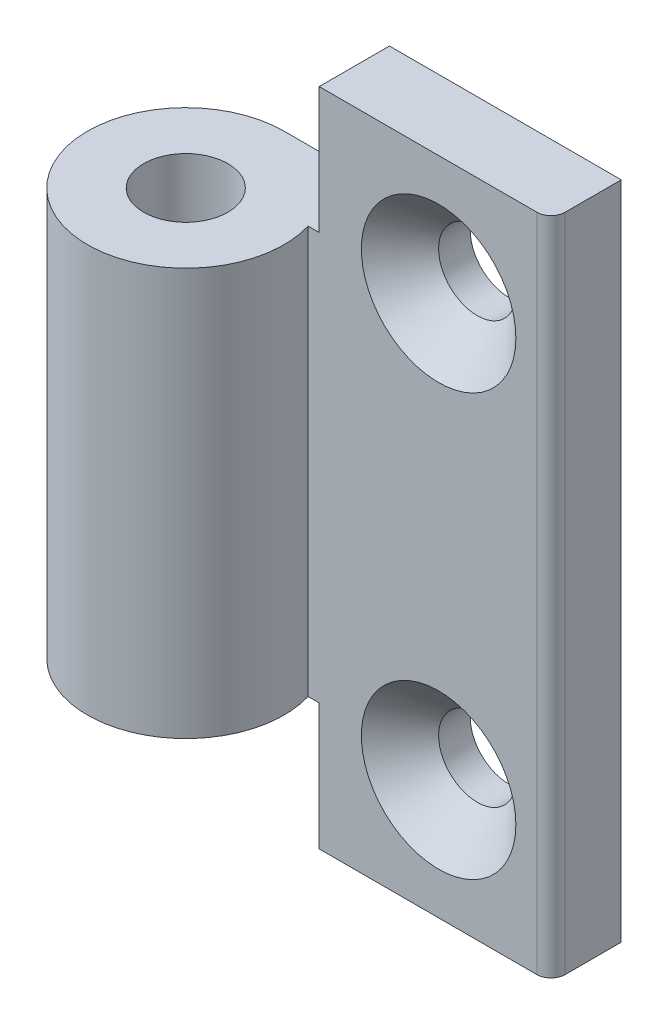
ISO-10303-21;
HEADER;
FILE_DESCRIPTION(('STEP AP214'),'2;1');
FILE_NAME('part.step','',(''),(''),'','','');
FILE_SCHEMA(('AUTOMOTIVE_DESIGN { 1 0 10303 214 1 1 1 1 }'));
ENDSEC;
DATA;
#1=APPLICATION_CONTEXT('core data for automotive mechanical design processes');
#2=APPLICATION_PROTOCOL_DEFINITION('international standard','automotive_design',2000,#1);
#3=PRODUCT_CONTEXT('',#1,'mechanical');
#4=PRODUCT('Part','Part','',(#3));
#5=PRODUCT_RELATED_PRODUCT_CATEGORY('part','',(#4));
#6=PRODUCT_DEFINITION_FORMATION('','',#4);
#7=PRODUCT_DEFINITION_CONTEXT('part definition',#1,'design');
#8=PRODUCT_DEFINITION('design','',#6,#7);
#9=PRODUCT_DEFINITION_SHAPE('','',#8);
#10=(LENGTH_UNIT() NAMED_UNIT(*) SI_UNIT(.MILLI.,.METRE.));
#11=(NAMED_UNIT(*) PLANE_ANGLE_UNIT() SI_UNIT($,.RADIAN.));
#12=(NAMED_UNIT(*) SI_UNIT($,.STERADIAN.) SOLID_ANGLE_UNIT());
#13=UNCERTAINTY_MEASURE_WITH_UNIT(LENGTH_MEASURE(1.E-05),#10,'distance_accuracy_value','');
#14=(GEOMETRIC_REPRESENTATION_CONTEXT(3) GLOBAL_UNCERTAINTY_ASSIGNED_CONTEXT((#13)) GLOBAL_UNIT_ASSIGNED_CONTEXT((#10,
#11,#12)) REPRESENTATION_CONTEXT('',''));
#15=CARTESIAN_POINT('',(0.,0.,0.));
#16=DIRECTION('',(0.,0.,1.));
#17=DIRECTION('',(1.,0.,0.));
#18=AXIS2_PLACEMENT_3D('',#15,#16,#17);
#19=CARTESIAN_POINT('',(16.,-15.,-1.99999999995271));
#20=DIRECTION('',(0.,0.,1.));
#21=DIRECTION('',(1.,0.,0.));
#22=AXIS2_PLACEMENT_3D('',#19,#20,#21);
#23=CONICAL_SURFACE('',#22,5.50000000000318,0.785398163397448);
#24=CARTESIAN_POINT('',(16.,-15.,-4.75));
#25=DIRECTION('',(0.,0.,-1.));
#26=DIRECTION('',(-1.,0.,0.));
#27=AXIS2_PLACEMENT_3D('',#24,#25,#26);
#28=CIRCLE('',#27,2.75);
#29=CARTESIAN_POINT('',(13.25,-15.,-4.75));
#30=VERTEX_POINT('',#29);
#31=EDGE_CURVE('E156',#30,#30,#28,.T.);
#32=ORIENTED_EDGE('',*,*,#31,.T.);
#33=EDGE_LOOP('',(#32));
#34=FACE_BOUND('',#33,.T.);
#35=CARTESIAN_POINT('',(16.,-15.,-1.99999999995271));
#36=DIRECTION('',(0.,0.,1.));
#37=DIRECTION('',(1.,0.,0.));
#38=AXIS2_PLACEMENT_3D('',#35,#36,#37);
#39=CIRCLE('',#38,5.50000000000318);
#40=CARTESIAN_POINT('',(21.5000000000032,-15.,-1.99999999995271));
#41=VERTEX_POINT('',#40);
#42=EDGE_CURVE('E150',#41,#41,#39,.F.);
#43=ORIENTED_EDGE('',*,*,#42,.F.);
#44=EDGE_LOOP('',(#43));
#45=FACE_BOUND('',#44,.T.);
#46=ADVANCED_FACE('F16',(#34,#45),#23,.F.);
#47=CARTESIAN_POINT('',(16.,15.,-1.99999999995271));
#48=DIRECTION('',(0.,0.,1.));
#49=DIRECTION('',(1.,0.,0.));
#50=AXIS2_PLACEMENT_3D('',#47,#48,#49);
#51=CONICAL_SURFACE('',#50,5.50000000000318,0.785398163397448);
#52=CARTESIAN_POINT('',(16.,15.,-4.75));
#53=DIRECTION('',(0.,0.,-1.));
#54=DIRECTION('',(-1.,0.,0.));
#55=AXIS2_PLACEMENT_3D('',#52,#53,#54);
#56=CIRCLE('',#55,2.75);
#57=CARTESIAN_POINT('',(13.25,15.,-4.75));
#58=VERTEX_POINT('',#57);
#59=EDGE_CURVE('E142',#58,#58,#56,.T.);
#60=ORIENTED_EDGE('',*,*,#59,.T.);
#61=EDGE_LOOP('',(#60));
#62=FACE_BOUND('',#61,.T.);
#63=CARTESIAN_POINT('',(16.,15.,-1.99999999995271));
#64=DIRECTION('',(0.,0.,1.));
#65=DIRECTION('',(1.,0.,0.));
#66=AXIS2_PLACEMENT_3D('',#63,#64,#65);
#67=CIRCLE('',#66,5.50000000000318);
#68=CARTESIAN_POINT('',(21.5000000000032,15.,-1.99999999995271));
#69=VERTEX_POINT('',#68);
#70=EDGE_CURVE('E186',#69,#69,#67,.F.);
#71=ORIENTED_EDGE('',*,*,#70,.F.);
#72=EDGE_LOOP('',(#71));
#73=FACE_BOUND('',#72,.T.);
#74=ADVANCED_FACE('F373',(#62,#73),#51,.F.);
#75=CARTESIAN_POINT('',(23.,23.5,-3.));
#76=DIRECTION('',(0.,1.,0.));
#77=DIRECTION('',(0.,0.,1.));
#78=AXIS2_PLACEMENT_3D('',#75,#76,#77);
#79=CYLINDRICAL_SURFACE('',#78,1.);
#80=CARTESIAN_POINT('',(23.,23.5,-3.));
#81=DIRECTION('',(0.,1.,0.));
#82=DIRECTION('',(0.,0.,1.));
#83=AXIS2_PLACEMENT_3D('',#80,#81,#82);
#84=CIRCLE('',#83,1.);
#85=CARTESIAN_POINT('',(24.,23.5,-3.));
#86=VERTEX_POINT('',#85);
#87=CARTESIAN_POINT('',(23.,23.5,-2.));
#88=VERTEX_POINT('',#87);
#89=EDGE_CURVE('E115',#86,#88,#84,.F.);
#90=ORIENTED_EDGE('',*,*,#89,.T.);
#91=DIRECTION('',(0.,1.,0.));
#92=VECTOR('',#91,1.);
#93=CARTESIAN_POINT('',(23.,0.,-2.));
#94=LINE('',#93,#92);
#95=CARTESIAN_POINT('',(23.,-23.5,-2.));
#96=VERTEX_POINT('',#95);
#97=EDGE_CURVE('E178',#96,#88,#94,.T.);
#98=ORIENTED_EDGE('',*,*,#97,.F.);
#99=CARTESIAN_POINT('',(23.,-23.5,-3.));
#100=DIRECTION('',(0.,1.,0.));
#101=DIRECTION('',(0.,0.,1.));
#102=AXIS2_PLACEMENT_3D('',#99,#100,#101);
#103=CIRCLE('',#102,1.);
#104=CARTESIAN_POINT('',(24.,-23.5,-3.));
#105=VERTEX_POINT('',#104);
#106=EDGE_CURVE('E19',#96,#105,#103,.T.);
#107=ORIENTED_EDGE('',*,*,#106,.T.);
#108=DIRECTION('',(0.,1.,0.));
#109=VECTOR('',#108,1.);
#110=CARTESIAN_POINT('',(24.,-23.5,-3.));
#111=LINE('',#110,#109);
#112=EDGE_CURVE('E116',#105,#86,#111,.T.);
#113=ORIENTED_EDGE('',*,*,#112,.T.);
#114=EDGE_LOOP('',(#90,#98,#107,#113));
#115=FACE_BOUND('',#114,.T.);
#116=ADVANCED_FACE('F364',(#115),#79,.T.);
#117=CARTESIAN_POINT('',(0.,-23.5,0.));
#118=DIRECTION('',(0.,1.,0.));
#119=DIRECTION('',(0.,0.,1.));
#120=AXIS2_PLACEMENT_3D('',#117,#118,#119);
#121=CYLINDRICAL_SURFACE('',#120,3.);
#122=CARTESIAN_POINT('',(0.,14.5,0.));
#123=DIRECTION('',(0.,1.,0.));
#124=DIRECTION('',(0.,0.,1.));
#125=AXIS2_PLACEMENT_3D('',#122,#123,#124);
#126=CIRCLE('',#125,3.);
#127=CARTESIAN_POINT('',(0.,14.5,3.));
#128=VERTEX_POINT('',#127);
#129=EDGE_CURVE('E173',#128,#128,#126,.T.);
#130=ORIENTED_EDGE('',*,*,#129,.T.);
#131=EDGE_LOOP('',(#130));
#132=FACE_BOUND('',#131,.T.);
#133=CARTESIAN_POINT('',(0.,-14.5,0.));
#134=DIRECTION('',(0.,1.,0.));
#135=DIRECTION('',(0.,0.,1.));
#136=AXIS2_PLACEMENT_3D('',#133,#134,#135);
#137=CIRCLE('',#136,3.);
#138=CARTESIAN_POINT('',(0.,-14.5,3.));
#139=VERTEX_POINT('',#138);
#140=EDGE_CURVE('E151',#139,#139,#137,.F.);
#141=ORIENTED_EDGE('',*,*,#140,.T.);
#142=EDGE_LOOP('',(#141));
#143=FACE_BOUND('',#142,.T.);
#144=ADVANCED_FACE('F355',(#132,#143),#121,.F.);
#145=CARTESIAN_POINT('',(16.,-15.,-2.));
#146=DIRECTION('',(0.,0.,-1.));
#147=DIRECTION('',(-1.,0.,0.));
#148=AXIS2_PLACEMENT_3D('',#145,#146,#147);
#149=CYLINDRICAL_SURFACE('',#148,2.75);
#150=CARTESIAN_POINT('',(16.,-15.,-7.));
#151=DIRECTION('',(0.,0.,-1.));
#152=DIRECTION('',(-1.,0.,0.));
#153=AXIS2_PLACEMENT_3D('',#150,#151,#152);
#154=CIRCLE('',#153,2.75);
#155=CARTESIAN_POINT('',(13.25,-15.,-7.));
#156=VERTEX_POINT('',#155);
#157=EDGE_CURVE('E199',#156,#156,#154,.T.);
#158=ORIENTED_EDGE('',*,*,#157,.T.);
#159=EDGE_LOOP('',(#158));
#160=FACE_BOUND('',#159,.T.);
#161=ORIENTED_EDGE('',*,*,#31,.F.);
#162=EDGE_LOOP('',(#161));
#163=FACE_BOUND('',#162,.T.);
#164=ADVANCED_FACE('F258',(#160,#163),#149,.F.);
#165=CARTESIAN_POINT('',(16.,15.,-2.));
#166=DIRECTION('',(0.,0.,-1.));
#167=DIRECTION('',(-1.,0.,0.));
#168=AXIS2_PLACEMENT_3D('',#165,#166,#167);
#169=CYLINDRICAL_SURFACE('',#168,2.75);
#170=CARTESIAN_POINT('',(16.,15.,-7.));
#171=DIRECTION('',(0.,0.,-1.));
#172=DIRECTION('',(-1.,0.,0.));
#173=AXIS2_PLACEMENT_3D('',#170,#171,#172);
#174=CIRCLE('',#173,2.75);
#175=CARTESIAN_POINT('',(13.25,15.,-7.));
#176=VERTEX_POINT('',#175);
#177=EDGE_CURVE('E196',#176,#176,#174,.T.);
#178=ORIENTED_EDGE('',*,*,#177,.T.);
#179=EDGE_LOOP('',(#178));
#180=FACE_BOUND('',#179,.T.);
#181=ORIENTED_EDGE('',*,*,#59,.F.);
#182=EDGE_LOOP('',(#181));
#183=FACE_BOUND('',#182,.T.);
#184=ADVANCED_FACE('F250',(#180,#183),#169,.F.);
#185=CARTESIAN_POINT('',(7.5,-14.5,7.));
#186=DIRECTION('',(1.,0.,0.));
#187=DIRECTION('',(0.,0.,-1.));
#188=AXIS2_PLACEMENT_3D('',#185,#186,#187);
#189=PLANE('',#188);
#190=DIRECTION('',(0.,0.,1.));
#191=VECTOR('',#190,1.);
#192=CARTESIAN_POINT('',(7.5,-14.5,7.));
#193=LINE('',#192,#191);
#194=CARTESIAN_POINT('',(7.5,-14.5,-2.));
#195=VERTEX_POINT('',#194);
#196=CARTESIAN_POINT('',(7.5,-14.5,-7.));
#197=VERTEX_POINT('',#196);
#198=EDGE_CURVE('E81',#195,#197,#193,.F.);
#199=ORIENTED_EDGE('',*,*,#198,.T.);
#200=DIRECTION('',(0.,1.,0.));
#201=VECTOR('',#200,1.);
#202=CARTESIAN_POINT('',(7.5,0.,-7.));
#203=LINE('',#202,#201);
#204=CARTESIAN_POINT('',(7.5,-23.5,-7.));
#205=VERTEX_POINT('',#204);
#206=EDGE_CURVE('E75',#197,#205,#203,.F.);
#207=ORIENTED_EDGE('',*,*,#206,.T.);
#208=DIRECTION('',(0.,0.,1.));
#209=VECTOR('',#208,1.);
#210=CARTESIAN_POINT('',(7.5,-23.5,0.));
#211=LINE('',#210,#209);
#212=CARTESIAN_POINT('',(7.5,-23.5,-2.));
#213=VERTEX_POINT('',#212);
#214=EDGE_CURVE('E67',#205,#213,#211,.T.);
#215=ORIENTED_EDGE('',*,*,#214,.T.);
#216=DIRECTION('',(0.,1.,0.));
#217=VECTOR('',#216,1.);
#218=CARTESIAN_POINT('',(7.5,0.,-2.));
#219=LINE('',#218,#217);
#220=EDGE_CURVE('E170',#195,#213,#219,.F.);
#221=ORIENTED_EDGE('',*,*,#220,.F.);
#222=EDGE_LOOP('',(#199,#207,#215,#221));
#223=FACE_BOUND('',#222,.T.);
#224=ADVANCED_FACE('F248',(#223),#189,.F.);
#225=CARTESIAN_POINT('',(7.,-23.5,0.));
#226=DIRECTION('',(0.,1.,0.));
#227=DIRECTION('',(0.,0.,1.));
#228=AXIS2_PLACEMENT_3D('',#225,#226,#227);
#229=PLANE('',#228);
#230=ORIENTED_EDGE('',*,*,#106,.F.);
#231=DIRECTION('',(1.,0.,0.));
#232=VECTOR('',#231,1.);
#233=CARTESIAN_POINT('',(0.,-23.5,-2.));
#234=LINE('',#233,#232);
#235=EDGE_CURVE('E183',#213,#96,#234,.T.);
#236=ORIENTED_EDGE('',*,*,#235,.F.);
#237=ORIENTED_EDGE('',*,*,#214,.F.);
#238=DIRECTION('',(1.,0.,0.));
#239=VECTOR('',#238,1.);
#240=CARTESIAN_POINT('',(0.,-23.5,-7.));
#241=LINE('',#240,#239);
#242=CARTESIAN_POINT('',(24.,-23.5,-7.));
#243=VERTEX_POINT('',#242);
#244=EDGE_CURVE('E109',#205,#243,#241,.T.);
#245=ORIENTED_EDGE('',*,*,#244,.T.);
#246=DIRECTION('',(0.,0.,1.));
#247=VECTOR('',#246,1.);
#248=CARTESIAN_POINT('',(24.,-23.5,-2.));
#249=LINE('',#248,#247);
#250=EDGE_CURVE('E104',#243,#105,#249,.T.);
#251=ORIENTED_EDGE('',*,*,#250,.T.);
#252=EDGE_LOOP('',(#230,#236,#237,#245,#251));
#253=FACE_BOUND('',#252,.T.);
#254=ADVANCED_FACE('F247',(#253),#229,.F.);
#255=CARTESIAN_POINT('',(24.,-23.5,-2.));
#256=DIRECTION('',(-1.,0.,0.));
#257=DIRECTION('',(0.,0.,1.));
#258=AXIS2_PLACEMENT_3D('',#255,#256,#257);
#259=PLANE('',#258);
#260=ORIENTED_EDGE('',*,*,#250,.F.);
#261=DIRECTION('',(0.,1.,0.));
#262=VECTOR('',#261,1.);
#263=CARTESIAN_POINT('',(24.,0.,-7.));
#264=LINE('',#263,#262);
#265=CARTESIAN_POINT('',(24.,23.5,-7.));
#266=VERTEX_POINT('',#265);
#267=EDGE_CURVE('E98',#243,#266,#264,.T.);
#268=ORIENTED_EDGE('',*,*,#267,.T.);
#269=DIRECTION('',(0.,0.,-1.));
#270=VECTOR('',#269,1.);
#271=CARTESIAN_POINT('',(24.,23.5,0.));
#272=LINE('',#271,#270);
#273=EDGE_CURVE('E102',#266,#86,#272,.F.);
#274=ORIENTED_EDGE('',*,*,#273,.T.);
#275=ORIENTED_EDGE('',*,*,#112,.F.);
#276=EDGE_LOOP('',(#260,#268,#274,#275));
#277=FACE_BOUND('',#276,.T.);
#278=ADVANCED_FACE('F100',(#277),#259,.F.);
#279=CARTESIAN_POINT('',(0.,23.5,0.));
#280=DIRECTION('',(0.,-1.,0.));
#281=DIRECTION('',(0.,0.,-1.));
#282=AXIS2_PLACEMENT_3D('',#279,#280,#281);
#283=PLANE('',#282);
#284=ORIENTED_EDGE('',*,*,#89,.F.);
#285=ORIENTED_EDGE('',*,*,#273,.F.);
#286=DIRECTION('',(1.,0.,0.));
#287=VECTOR('',#286,1.);
#288=CARTESIAN_POINT('',(0.,23.5,-7.));
#289=LINE('',#288,#287);
#290=CARTESIAN_POINT('',(7.5,23.5,-7.));
#291=VERTEX_POINT('',#290);
#292=EDGE_CURVE('E108',#266,#291,#289,.F.);
#293=ORIENTED_EDGE('',*,*,#292,.T.);
#294=DIRECTION('',(0.,0.,1.));
#295=VECTOR('',#294,1.);
#296=CARTESIAN_POINT('',(7.5,23.5,7.));
#297=LINE('',#296,#295);
#298=CARTESIAN_POINT('',(7.5,23.5,-2.));
#299=VERTEX_POINT('',#298);
#300=EDGE_CURVE('E211',#291,#299,#297,.T.);
#301=ORIENTED_EDGE('',*,*,#300,.T.);
#302=DIRECTION('',(1.,0.,0.));
#303=VECTOR('',#302,1.);
#304=CARTESIAN_POINT('',(0.,23.5,-2.));
#305=LINE('',#304,#303);
#306=EDGE_CURVE('E167',#88,#299,#305,.F.);
#307=ORIENTED_EDGE('',*,*,#306,.F.);
#308=EDGE_LOOP('',(#284,#285,#293,#301,#307));
#309=FACE_BOUND('',#308,.T.);
#310=ADVANCED_FACE('F112',(#309),#283,.F.);
#311=CARTESIAN_POINT('',(7.5,23.5,7.));
#312=DIRECTION('',(1.,0.,0.));
#313=DIRECTION('',(0.,1.,0.));
#314=AXIS2_PLACEMENT_3D('',#311,#312,#313);
#315=PLANE('',#314);
#316=ORIENTED_EDGE('',*,*,#300,.F.);
#317=DIRECTION('',(0.,1.,0.));
#318=VECTOR('',#317,1.);
#319=CARTESIAN_POINT('',(7.5,0.,-7.));
#320=LINE('',#319,#318);
#321=CARTESIAN_POINT('',(7.5,14.5,-7.));
#322=VERTEX_POINT('',#321);
#323=EDGE_CURVE('E122',#291,#322,#320,.F.);
#324=ORIENTED_EDGE('',*,*,#323,.T.);
#325=DIRECTION('',(0.,0.,-1.));
#326=VECTOR('',#325,1.);
#327=CARTESIAN_POINT('',(7.5,14.5,7.));
#328=LINE('',#327,#326);
#329=CARTESIAN_POINT('',(7.5,14.5,-2.));
#330=VERTEX_POINT('',#329);
#331=EDGE_CURVE('E205',#322,#330,#328,.F.);
#332=ORIENTED_EDGE('',*,*,#331,.T.);
#333=DIRECTION('',(0.,1.,0.));
#334=VECTOR('',#333,1.);
#335=CARTESIAN_POINT('',(7.5,0.,-2.));
#336=LINE('',#335,#334);
#337=EDGE_CURVE('E163',#299,#330,#336,.F.);
#338=ORIENTED_EDGE('',*,*,#337,.F.);
#339=EDGE_LOOP('',(#316,#324,#332,#338));
#340=FACE_BOUND('',#339,.T.);
#341=ADVANCED_FACE('F274',(#340),#315,.F.);
#342=CARTESIAN_POINT('',(-7.,-14.5,7.));
#343=DIRECTION('',(0.,1.,0.));
#344=DIRECTION('',(0.,0.,1.));
#345=AXIS2_PLACEMENT_3D('',#342,#343,#344);
#346=PLANE('',#345);
#347=CARTESIAN_POINT('',(0.,-14.5,0.));
#348=DIRECTION('',(0.,1.,0.));
#349=DIRECTION('',(0.,0.,1.));
#350=AXIS2_PLACEMENT_3D('',#347,#348,#349);
#351=CIRCLE('',#350,7.);
#352=CARTESIAN_POINT('',(0.,-14.5,-7.));
#353=VERTEX_POINT('',#352);
#354=CARTESIAN_POINT('',(6.70820393249937,-14.5,-2.));
#355=VERTEX_POINT('',#354);
#356=EDGE_CURVE('E193',#353,#355,#351,.T.);
#357=ORIENTED_EDGE('',*,*,#356,.F.);
#358=DIRECTION('',(1.,0.,0.));
#359=VECTOR('',#358,1.);
#360=CARTESIAN_POINT('',(0.,-14.5,-7.));
#361=LINE('',#360,#359);
#362=EDGE_CURVE('E146',#353,#197,#361,.T.);
#363=ORIENTED_EDGE('',*,*,#362,.T.);
#364=ORIENTED_EDGE('',*,*,#198,.F.);
#365=DIRECTION('',(1.,0.,0.));
#366=VECTOR('',#365,1.);
#367=CARTESIAN_POINT('',(0.,-14.5,-2.));
#368=LINE('',#367,#366);
#369=EDGE_CURVE('E166',#355,#195,#368,.T.);
#370=ORIENTED_EDGE('',*,*,#369,.F.);
#371=EDGE_LOOP('',(#357,#363,#364,#370));
#372=FACE_BOUND('',#371,.T.);
#373=ORIENTED_EDGE('',*,*,#140,.F.);
#374=EDGE_LOOP('',(#373));
#375=FACE_BOUND('',#374,.T.);
#376=ADVANCED_FACE('F245',(#372,#375),#346,.F.);
#377=CARTESIAN_POINT('',(0.,0.,-2.));
#378=DIRECTION('',(0.,0.,1.));
#379=DIRECTION('',(1.,0.,0.));
#380=AXIS2_PLACEMENT_3D('',#377,#378,#379);
#381=PLANE('',#380);
#382=ORIENTED_EDGE('',*,*,#369,.T.);
#383=ORIENTED_EDGE('',*,*,#220,.T.);
#384=ORIENTED_EDGE('',*,*,#235,.T.);
#385=ORIENTED_EDGE('',*,*,#97,.T.);
#386=ORIENTED_EDGE('',*,*,#306,.T.);
#387=ORIENTED_EDGE('',*,*,#337,.T.);
#388=DIRECTION('',(1.,0.,0.));
#389=VECTOR('',#388,1.);
#390=CARTESIAN_POINT('',(7.5,14.5,-2.));
#391=LINE('',#390,#389);
#392=CARTESIAN_POINT('',(6.70820393249937,14.5,-2.));
#393=VERTEX_POINT('',#392);
#394=EDGE_CURVE('E202',#330,#393,#391,.F.);
#395=ORIENTED_EDGE('',*,*,#394,.T.);
#396=DIRECTION('',(0.,1.,0.));
#397=VECTOR('',#396,1.);
#398=CARTESIAN_POINT('',(6.70820393249937,-23.5,-2.));
#399=LINE('',#398,#397);
#400=EDGE_CURVE('E192',#355,#393,#399,.T.);
#401=ORIENTED_EDGE('',*,*,#400,.F.);
#402=EDGE_LOOP('',(#382,#383,#384,#385,#386,#387,#395,#401));
#403=FACE_BOUND('',#402,.T.);
#404=ORIENTED_EDGE('',*,*,#70,.T.);
#405=EDGE_LOOP('',(#404));
#406=FACE_BOUND('',#405,.T.);
#407=ORIENTED_EDGE('',*,*,#42,.T.);
#408=EDGE_LOOP('',(#407));
#409=FACE_BOUND('',#408,.T.);
#410=ADVANCED_FACE('F237',(#403,#406,#409),#381,.T.);
#411=CARTESIAN_POINT('',(7.5,14.5,7.));
#412=DIRECTION('',(0.,-1.,0.));
#413=DIRECTION('',(0.,0.,-1.));
#414=AXIS2_PLACEMENT_3D('',#411,#412,#413);
#415=PLANE('',#414);
#416=ORIENTED_EDGE('',*,*,#331,.F.);
#417=DIRECTION('',(1.,0.,0.));
#418=VECTOR('',#417,1.);
#419=CARTESIAN_POINT('',(0.,14.5,-7.));
#420=LINE('',#419,#418);
#421=CARTESIAN_POINT('',(0.,14.5,-7.));
#422=VERTEX_POINT('',#421);
#423=EDGE_CURVE('E34',#322,#422,#420,.F.);
#424=ORIENTED_EDGE('',*,*,#423,.T.);
#425=CARTESIAN_POINT('',(0.,14.5,0.));
#426=DIRECTION('',(0.,1.,0.));
#427=DIRECTION('',(0.,0.,1.));
#428=AXIS2_PLACEMENT_3D('',#425,#426,#427);
#429=CIRCLE('',#428,7.);
#430=EDGE_CURVE('E25',#393,#422,#429,.F.);
#431=ORIENTED_EDGE('',*,*,#430,.F.);
#432=ORIENTED_EDGE('',*,*,#394,.F.);
#433=EDGE_LOOP('',(#416,#424,#431,#432));
#434=FACE_BOUND('',#433,.T.);
#435=ORIENTED_EDGE('',*,*,#129,.F.);
#436=EDGE_LOOP('',(#435));
#437=FACE_BOUND('',#436,.T.);
#438=ADVANCED_FACE('F239',(#434,#437),#415,.F.);
#439=CARTESIAN_POINT('',(0.,0.,-7.));
#440=DIRECTION('',(0.,0.,1.));
#441=DIRECTION('',(1.,0.,0.));
#442=AXIS2_PLACEMENT_3D('',#439,#440,#441);
#443=PLANE('',#442);
#444=ORIENTED_EDGE('',*,*,#423,.F.);
#445=ORIENTED_EDGE('',*,*,#323,.F.);
#446=ORIENTED_EDGE('',*,*,#292,.F.);
#447=ORIENTED_EDGE('',*,*,#267,.F.);
#448=ORIENTED_EDGE('',*,*,#244,.F.);
#449=ORIENTED_EDGE('',*,*,#206,.F.);
#450=ORIENTED_EDGE('',*,*,#362,.F.);
#451=DIRECTION('',(0.,1.,0.));
#452=VECTOR('',#451,1.);
#453=CARTESIAN_POINT('',(0.,-23.5,-7.));
#454=LINE('',#453,#452);
#455=EDGE_CURVE('E11',#422,#353,#454,.F.);
#456=ORIENTED_EDGE('',*,*,#455,.F.);
#457=EDGE_LOOP('',(#444,#445,#446,#447,#448,#449,#450,#456));
#458=FACE_BOUND('',#457,.T.);
#459=ORIENTED_EDGE('',*,*,#177,.F.);
#460=EDGE_LOOP('',(#459));
#461=FACE_BOUND('',#460,.T.);
#462=ORIENTED_EDGE('',*,*,#157,.F.);
#463=EDGE_LOOP('',(#462));
#464=FACE_BOUND('',#463,.T.);
#465=ADVANCED_FACE('F119',(#458,#461,#464),#443,.F.);
#466=CARTESIAN_POINT('',(0.,-23.5,0.));
#467=DIRECTION('',(0.,1.,0.));
#468=DIRECTION('',(0.,0.,1.));
#469=AXIS2_PLACEMENT_3D('',#466,#467,#468);
#470=CYLINDRICAL_SURFACE('',#469,7.);
#471=ORIENTED_EDGE('',*,*,#430,.T.);
#472=ORIENTED_EDGE('',*,*,#455,.T.);
#473=ORIENTED_EDGE('',*,*,#356,.T.);
#474=ORIENTED_EDGE('',*,*,#400,.T.);
#475=EDGE_LOOP('',(#471,#472,#473,#474));
#476=FACE_BOUND('',#475,.T.);
#477=ADVANCED_FACE('F242',(#476),#470,.T.);
#478=CLOSED_SHELL('',(#46,#74,#116,#144,#164,#184,#224,#254,#278,#310,#341,#376,#410,#438,#465,#477));
#479=MANIFOLD_SOLID_BREP('B1',#478);
#480=ADVANCED_BREP_SHAPE_REPRESENTATION('',(#18,#479),#14);
#481=SHAPE_DEFINITION_REPRESENTATION(#9,#480);
ENDSEC;
END-ISO-10303-21;
